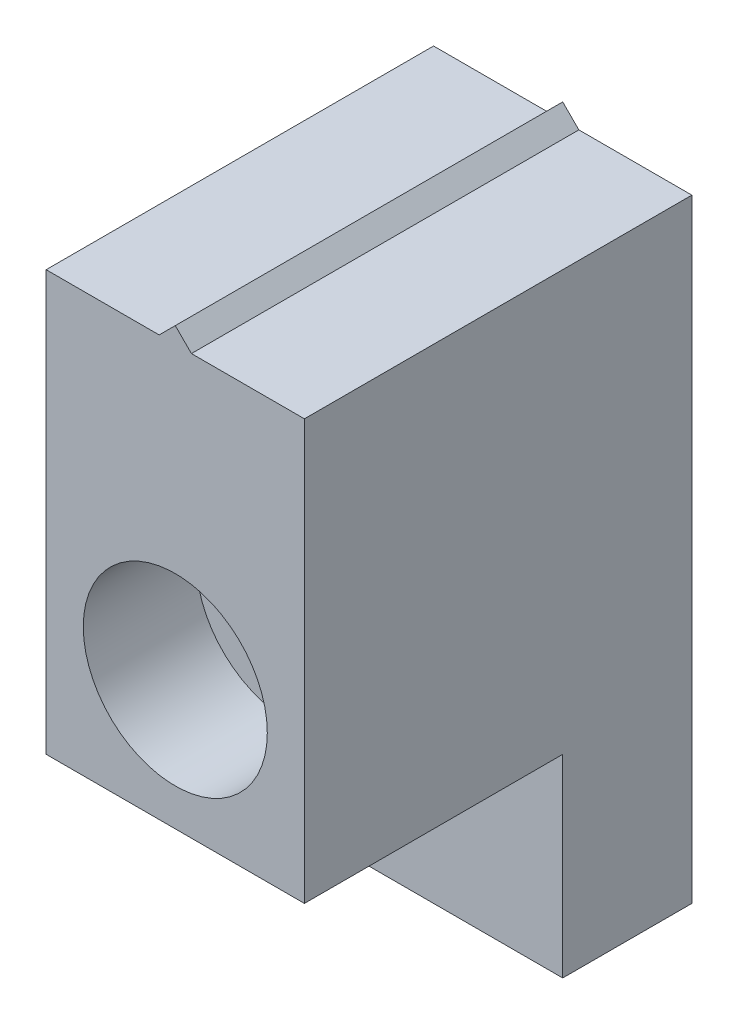
ISO-10303-21;
HEADER;
FILE_DESCRIPTION(('STEP AP214'),'2;1');
FILE_NAME('part.step','',(''),(''),'','','');
FILE_SCHEMA(('AUTOMOTIVE_DESIGN { 1 0 10303 214 1 1 1 1 }'));
ENDSEC;
DATA;
#1=APPLICATION_CONTEXT('core data for automotive mechanical design processes');
#2=APPLICATION_PROTOCOL_DEFINITION('international standard','automotive_design',2000,#1);
#3=PRODUCT_CONTEXT('',#1,'mechanical');
#4=PRODUCT('Part','Part','',(#3));
#5=PRODUCT_RELATED_PRODUCT_CATEGORY('part','',(#4));
#6=PRODUCT_DEFINITION_FORMATION('','',#4);
#7=PRODUCT_DEFINITION_CONTEXT('part definition',#1,'design');
#8=PRODUCT_DEFINITION('design','',#6,#7);
#9=PRODUCT_DEFINITION_SHAPE('','',#8);
#10=(LENGTH_UNIT() NAMED_UNIT(*) SI_UNIT(.MILLI.,.METRE.));
#11=(NAMED_UNIT(*) PLANE_ANGLE_UNIT() SI_UNIT($,.RADIAN.));
#12=(NAMED_UNIT(*) SI_UNIT($,.STERADIAN.) SOLID_ANGLE_UNIT());
#13=UNCERTAINTY_MEASURE_WITH_UNIT(LENGTH_MEASURE(1.E-05),#10,'distance_accuracy_value','');
#14=(GEOMETRIC_REPRESENTATION_CONTEXT(3) GLOBAL_UNCERTAINTY_ASSIGNED_CONTEXT((#13)) GLOBAL_UNIT_ASSIGNED_CONTEXT((#10,
#11,#12)) REPRESENTATION_CONTEXT('',''));
#15=CARTESIAN_POINT('',(0.,0.,0.));
#16=DIRECTION('',(0.,0.,1.));
#17=DIRECTION('',(1.,0.,0.));
#18=AXIS2_PLACEMENT_3D('',#15,#16,#17);
#19=CARTESIAN_POINT('',(4.00000005960464,19.5000002905726,0.));
#20=DIRECTION('',(-0.707106781186548,0.707106781186548,0.));
#21=DIRECTION('',(-0.707106781186548,-0.707106781186548,0.));
#22=AXIS2_PLACEMENT_3D('',#19,#20,#21);
#23=PLANE('',#22);
#24=DIRECTION('',(-0.707106781186548,-0.707106781186548,0.));
#25=VECTOR('',#24,1.);
#26=CARTESIAN_POINT('',(4.00000005960464,19.5000002905726,12.));
#27=LINE('',#26,#25);
#28=CARTESIAN_POINT('',(3.50000005215408,19.0000002831221,12.));
#29=VERTEX_POINT('',#28);
#30=CARTESIAN_POINT('',(4.00000005960465,19.5000002905726,12.));
#31=VERTEX_POINT('',#30);
#32=EDGE_CURVE('E90',#29,#31,#27,.F.);
#33=ORIENTED_EDGE('',*,*,#32,.T.);
#34=DIRECTION('',(0.,0.,1.));
#35=VECTOR('',#34,1.);
#36=CARTESIAN_POINT('',(4.00000005960469,19.5000002905726,0.));
#37=LINE('',#36,#35);
#38=CARTESIAN_POINT('',(4.00000005960465,19.5000002905726,0.));
#39=VERTEX_POINT('',#38);
#40=EDGE_CURVE('E93',#39,#31,#37,.T.);
#41=ORIENTED_EDGE('',*,*,#40,.F.);
#42=DIRECTION('',(-0.707106781186548,-0.707106781186548,0.));
#43=VECTOR('',#42,1.);
#44=CARTESIAN_POINT('',(4.00000005960464,19.5000002905726,0.));
#45=LINE('',#44,#43);
#46=CARTESIAN_POINT('',(3.50000005215408,19.0000002831221,0.));
#47=VERTEX_POINT('',#46);
#48=EDGE_CURVE('E85',#39,#47,#45,.T.);
#49=ORIENTED_EDGE('',*,*,#48,.T.);
#50=DIRECTION('',(0.,0.,1.));
#51=VECTOR('',#50,1.);
#52=CARTESIAN_POINT('',(3.50000005215406,19.0000002831221,0.));
#53=LINE('',#52,#51);
#54=EDGE_CURVE('E96',#29,#47,#53,.F.);
#55=ORIENTED_EDGE('',*,*,#54,.F.);
#56=EDGE_LOOP('',(#33,#41,#49,#55));
#57=FACE_BOUND('',#56,.T.);
#58=ADVANCED_FACE('F17',(#57),#23,.T.);
#59=CARTESIAN_POINT('',(4.00000005960464,10.0000001490116,8.5));
#60=DIRECTION('',(0.,0.,1.));
#61=DIRECTION('',(1.,0.,0.));
#62=AXIS2_PLACEMENT_3D('',#59,#60,#61);
#63=PLANE('',#62);
#64=CARTESIAN_POINT('',(4.00000005960464,10.0000001490116,8.5));
#65=DIRECTION('',(0.,0.,1.));
#66=DIRECTION('',(1.,0.,0.));
#67=AXIS2_PLACEMENT_3D('',#64,#65,#66);
#68=CIRCLE('',#67,1.55);
#69=CARTESIAN_POINT('',(5.55000005960464,10.0000001490116,8.5));
#70=VERTEX_POINT('',#69);
#71=EDGE_CURVE('E20',#70,#70,#68,.F.);
#72=ORIENTED_EDGE('',*,*,#71,.T.);
#73=EDGE_LOOP('',(#72));
#74=FACE_BOUND('',#73,.T.);
#75=CARTESIAN_POINT('',(4.00000005960464,10.0000001490116,8.5));
#76=DIRECTION('',(0.,0.,1.));
#77=DIRECTION('',(1.,0.,0.));
#78=AXIS2_PLACEMENT_3D('',#75,#76,#77);
#79=CIRCLE('',#78,2.85);
#80=CARTESIAN_POINT('',(6.85000005960464,10.0000001490116,8.5));
#81=VERTEX_POINT('',#80);
#82=EDGE_CURVE('E125',#81,#81,#79,.T.);
#83=ORIENTED_EDGE('',*,*,#82,.T.);
#84=EDGE_LOOP('',(#83));
#85=FACE_BOUND('',#84,.T.);
#86=ADVANCED_FACE('F302',(#74,#85),#63,.T.);
#87=CARTESIAN_POINT('',(4.00000005960464,10.0000001490116,0.));
#88=DIRECTION('',(0.,0.,1.));
#89=DIRECTION('',(1.,0.,0.));
#90=AXIS2_PLACEMENT_3D('',#87,#88,#89);
#91=CYLINDRICAL_SURFACE('',#90,1.55);
#92=CARTESIAN_POINT('',(4.00000005960464,10.0000001490116,0.));
#93=DIRECTION('',(0.,0.,1.));
#94=DIRECTION('',(1.,0.,0.));
#95=AXIS2_PLACEMENT_3D('',#92,#93,#94);
#96=CIRCLE('',#95,1.55);
#97=CARTESIAN_POINT('',(5.55000005960464,10.0000001490116,0.));
#98=VERTEX_POINT('',#97);
#99=EDGE_CURVE('E121',#98,#98,#96,.F.);
#100=ORIENTED_EDGE('',*,*,#99,.T.);
#101=EDGE_LOOP('',(#100));
#102=FACE_BOUND('',#101,.T.);
#103=ORIENTED_EDGE('',*,*,#71,.F.);
#104=EDGE_LOOP('',(#103));
#105=FACE_BOUND('',#104,.T.);
#106=ADVANCED_FACE('F206',(#102,#105),#91,.F.);
#107=CARTESIAN_POINT('',(4.50000006705523,19.0000002831221,0.));
#108=DIRECTION('',(0.707106781186548,0.707106781186548,0.));
#109=DIRECTION('',(-0.707106781186548,0.707106781186548,0.));
#110=AXIS2_PLACEMENT_3D('',#107,#108,#109);
#111=PLANE('',#110);
#112=DIRECTION('',(-0.707106781186548,0.707106781186548,0.));
#113=VECTOR('',#112,1.);
#114=CARTESIAN_POINT('',(4.50000006705523,19.0000002831221,12.));
#115=LINE('',#114,#113);
#116=CARTESIAN_POINT('',(4.50000006705523,19.0000002831221,12.));
#117=VERTEX_POINT('',#116);
#118=EDGE_CURVE('E102',#31,#117,#115,.F.);
#119=ORIENTED_EDGE('',*,*,#118,.T.);
#120=DIRECTION('',(0.,0.,1.));
#121=VECTOR('',#120,1.);
#122=CARTESIAN_POINT('',(4.50000006705523,19.0000002831221,0.));
#123=LINE('',#122,#121);
#124=CARTESIAN_POINT('',(4.50000006705523,19.0000002831221,0.));
#125=VERTEX_POINT('',#124);
#126=EDGE_CURVE('E123',#125,#117,#123,.T.);
#127=ORIENTED_EDGE('',*,*,#126,.F.);
#128=DIRECTION('',(-0.707106781186611,0.707106781186484,0.));
#129=VECTOR('',#128,1.);
#130=CARTESIAN_POINT('',(4.50000006705523,19.0000002831221,0.));
#131=LINE('',#130,#129);
#132=EDGE_CURVE('E110',#125,#39,#131,.T.);
#133=ORIENTED_EDGE('',*,*,#132,.T.);
#134=ORIENTED_EDGE('',*,*,#40,.T.);
#135=EDGE_LOOP('',(#119,#127,#133,#134));
#136=FACE_BOUND('',#135,.T.);
#137=ADVANCED_FACE('F109',(#136),#111,.T.);
#138=CARTESIAN_POINT('',(8.00000011920929,19.0000002831221,0.));
#139=DIRECTION('',(0.,1.,0.));
#140=DIRECTION('',(0.,0.,1.));
#141=AXIS2_PLACEMENT_3D('',#138,#139,#140);
#142=PLANE('',#141);
#143=DIRECTION('',(0.,0.,1.));
#144=VECTOR('',#143,1.);
#145=CARTESIAN_POINT('',(0.,19.0000002831221,0.));
#146=LINE('',#145,#144);
#147=CARTESIAN_POINT('',(0.,19.0000002831221,12.));
#148=VERTEX_POINT('',#147);
#149=CARTESIAN_POINT('',(0.,19.0000002831221,0.));
#150=VERTEX_POINT('',#149);
#151=EDGE_CURVE('E127',#148,#150,#146,.F.);
#152=ORIENTED_EDGE('',*,*,#151,.F.);
#153=DIRECTION('',(1.,0.,0.));
#154=VECTOR('',#153,1.);
#155=CARTESIAN_POINT('',(4.00000005960464,19.0000002831221,12.));
#156=LINE('',#155,#154);
#157=EDGE_CURVE('E120',#29,#148,#156,.F.);
#158=ORIENTED_EDGE('',*,*,#157,.F.);
#159=ORIENTED_EDGE('',*,*,#54,.T.);
#160=DIRECTION('',(1.,0.,0.));
#161=VECTOR('',#160,1.);
#162=CARTESIAN_POINT('',(4.00000005960464,19.0000002831221,0.));
#163=LINE('',#162,#161);
#164=EDGE_CURVE('E135',#47,#150,#163,.F.);
#165=ORIENTED_EDGE('',*,*,#164,.T.);
#166=EDGE_LOOP('',(#152,#158,#159,#165));
#167=FACE_BOUND('',#166,.T.);
#168=ADVANCED_FACE('F195',(#167),#142,.T.);
#169=CARTESIAN_POINT('',(4.00000005960464,10.0000001490116,0.));
#170=DIRECTION('',(0.,0.,1.));
#171=DIRECTION('',(1.,0.,0.));
#172=AXIS2_PLACEMENT_3D('',#169,#170,#171);
#173=CYLINDRICAL_SURFACE('',#172,2.85);
#174=ORIENTED_EDGE('',*,*,#82,.F.);
#175=EDGE_LOOP('',(#174));
#176=FACE_BOUND('',#175,.T.);
#177=CARTESIAN_POINT('',(4.00000005960464,10.0000001490116,12.));
#178=DIRECTION('',(0.,0.,1.));
#179=DIRECTION('',(1.,0.,0.));
#180=AXIS2_PLACEMENT_3D('',#177,#178,#179);
#181=CIRCLE('',#180,2.85);
#182=CARTESIAN_POINT('',(6.85000005960464,10.0000001490116,12.));
#183=VERTEX_POINT('',#182);
#184=EDGE_CURVE('E116',#183,#183,#181,.F.);
#185=ORIENTED_EDGE('',*,*,#184,.F.);
#186=EDGE_LOOP('',(#185));
#187=FACE_BOUND('',#186,.T.);
#188=ADVANCED_FACE('F197',(#176,#187),#173,.F.);
#189=CARTESIAN_POINT('',(0.,6.00000008940697,0.));
#190=DIRECTION('',(-1.,0.,0.));
#191=DIRECTION('',(0.,0.,1.));
#192=AXIS2_PLACEMENT_3D('',#189,#190,#191);
#193=PLANE('',#192);
#194=DIRECTION('',(0.,1.,0.));
#195=VECTOR('',#194,1.);
#196=CARTESIAN_POINT('',(0.,12.5000001862645,12.));
#197=LINE('',#196,#195);
#198=CARTESIAN_POINT('',(0.,6.00000008940697,12.));
#199=VERTEX_POINT('',#198);
#200=EDGE_CURVE('E142',#148,#199,#197,.F.);
#201=ORIENTED_EDGE('',*,*,#200,.F.);
#202=ORIENTED_EDGE('',*,*,#151,.T.);
#203=DIRECTION('',(0.,1.,0.));
#204=VECTOR('',#203,1.);
#205=CARTESIAN_POINT('',(0.,3.00000004470348,0.));
#206=LINE('',#205,#204);
#207=CARTESIAN_POINT('',(0.,0.,0.));
#208=VERTEX_POINT('',#207);
#209=EDGE_CURVE('E124',#150,#208,#206,.F.);
#210=ORIENTED_EDGE('',*,*,#209,.T.);
#211=DIRECTION('',(0.,0.,-1.));
#212=VECTOR('',#211,1.);
#213=CARTESIAN_POINT('',(0.,0.,0.));
#214=LINE('',#213,#212);
#215=CARTESIAN_POINT('',(0.,0.,4.));
#216=VERTEX_POINT('',#215);
#217=EDGE_CURVE('E160',#216,#208,#214,.T.);
#218=ORIENTED_EDGE('',*,*,#217,.F.);
#219=DIRECTION('',(0.,1.,0.));
#220=VECTOR('',#219,1.);
#221=CARTESIAN_POINT('',(0.,3.00000004470348,4.));
#222=LINE('',#221,#220);
#223=CARTESIAN_POINT('',(0.,6.00000008940697,4.));
#224=VERTEX_POINT('',#223);
#225=EDGE_CURVE('E151',#224,#216,#222,.F.);
#226=ORIENTED_EDGE('',*,*,#225,.F.);
#227=DIRECTION('',(0.,0.,-1.));
#228=VECTOR('',#227,1.);
#229=CARTESIAN_POINT('',(0.,6.00000008940697,0.));
#230=LINE('',#229,#228);
#231=EDGE_CURVE('E148',#199,#224,#230,.T.);
#232=ORIENTED_EDGE('',*,*,#231,.F.);
#233=EDGE_LOOP('',(#201,#202,#210,#218,#226,#232));
#234=FACE_BOUND('',#233,.T.);
#235=ADVANCED_FACE('F186',(#234),#193,.T.);
#236=CARTESIAN_POINT('',(4.00000005960464,3.00000004470348,0.));
#237=DIRECTION('',(0.,0.,1.));
#238=DIRECTION('',(1.,0.,0.));
#239=AXIS2_PLACEMENT_3D('',#236,#237,#238);
#240=PLANE('',#239);
#241=ORIENTED_EDGE('',*,*,#99,.F.);
#242=EDGE_LOOP('',(#241));
#243=FACE_BOUND('',#242,.T.);
#244=ORIENTED_EDGE('',*,*,#164,.F.);
#245=ORIENTED_EDGE('',*,*,#48,.F.);
#246=ORIENTED_EDGE('',*,*,#132,.F.);
#247=DIRECTION('',(1.,0.,0.));
#248=VECTOR('',#247,1.);
#249=CARTESIAN_POINT('',(8.00000011920929,19.0000002831221,0.));
#250=LINE('',#249,#248);
#251=CARTESIAN_POINT('',(8.00000011920929,19.0000002831221,0.));
#252=VERTEX_POINT('',#251);
#253=EDGE_CURVE('E139',#252,#125,#250,.F.);
#254=ORIENTED_EDGE('',*,*,#253,.F.);
#255=DIRECTION('',(0.,1.,0.));
#256=VECTOR('',#255,1.);
#257=CARTESIAN_POINT('',(8.00000011920929,0.,0.));
#258=LINE('',#257,#256);
#259=CARTESIAN_POINT('',(8.00000011920929,0.,0.));
#260=VERTEX_POINT('',#259);
#261=EDGE_CURVE('E163',#260,#252,#258,.T.);
#262=ORIENTED_EDGE('',*,*,#261,.F.);
#263=DIRECTION('',(1.,0.,0.));
#264=VECTOR('',#263,1.);
#265=CARTESIAN_POINT('',(0.,0.,0.));
#266=LINE('',#265,#264);
#267=EDGE_CURVE('E156',#208,#260,#266,.T.);
#268=ORIENTED_EDGE('',*,*,#267,.F.);
#269=ORIENTED_EDGE('',*,*,#209,.F.);
#270=EDGE_LOOP('',(#244,#245,#246,#254,#262,#268,#269));
#271=FACE_BOUND('',#270,.T.);
#272=ADVANCED_FACE('F191',(#243,#271),#240,.F.);
#273=CARTESIAN_POINT('',(8.00000011920929,19.0000002831221,0.));
#274=DIRECTION('',(0.,1.,0.));
#275=DIRECTION('',(0.,0.,1.));
#276=AXIS2_PLACEMENT_3D('',#273,#274,#275);
#277=PLANE('',#276);
#278=DIRECTION('',(0.,0.,-1.));
#279=VECTOR('',#278,1.);
#280=CARTESIAN_POINT('',(8.00000011920929,19.0000002831221,0.));
#281=LINE('',#280,#279);
#282=CARTESIAN_POINT('',(8.00000011920929,19.0000002831221,12.));
#283=VERTEX_POINT('',#282);
#284=EDGE_CURVE('E166',#252,#283,#281,.F.);
#285=ORIENTED_EDGE('',*,*,#284,.F.);
#286=ORIENTED_EDGE('',*,*,#253,.T.);
#287=ORIENTED_EDGE('',*,*,#126,.T.);
#288=DIRECTION('',(1.,0.,0.));
#289=VECTOR('',#288,1.);
#290=CARTESIAN_POINT('',(4.00000005960464,19.0000002831221,12.));
#291=LINE('',#290,#289);
#292=EDGE_CURVE('E105',#283,#117,#291,.F.);
#293=ORIENTED_EDGE('',*,*,#292,.F.);
#294=EDGE_LOOP('',(#285,#286,#287,#293));
#295=FACE_BOUND('',#294,.T.);
#296=ADVANCED_FACE('F194',(#295),#277,.T.);
#297=CARTESIAN_POINT('',(4.00000005960464,12.5000001862645,12.));
#298=DIRECTION('',(0.,0.,1.));
#299=DIRECTION('',(1.,0.,0.));
#300=AXIS2_PLACEMENT_3D('',#297,#298,#299);
#301=PLANE('',#300);
#302=ORIENTED_EDGE('',*,*,#184,.T.);
#303=EDGE_LOOP('',(#302));
#304=FACE_BOUND('',#303,.T.);
#305=ORIENTED_EDGE('',*,*,#32,.F.);
#306=ORIENTED_EDGE('',*,*,#157,.T.);
#307=ORIENTED_EDGE('',*,*,#200,.T.);
#308=DIRECTION('',(1.,0.,0.));
#309=VECTOR('',#308,1.);
#310=CARTESIAN_POINT('',(0.,6.00000008940697,12.));
#311=LINE('',#310,#309);
#312=CARTESIAN_POINT('',(8.00000011920929,6.00000008940697,12.));
#313=VERTEX_POINT('',#312);
#314=EDGE_CURVE('E119',#313,#199,#311,.F.);
#315=ORIENTED_EDGE('',*,*,#314,.F.);
#316=DIRECTION('',(0.,1.,0.));
#317=VECTOR('',#316,1.);
#318=CARTESIAN_POINT('',(8.00000011920929,0.,12.));
#319=LINE('',#318,#317);
#320=EDGE_CURVE('E169',#283,#313,#319,.F.);
#321=ORIENTED_EDGE('',*,*,#320,.F.);
#322=ORIENTED_EDGE('',*,*,#292,.T.);
#323=ORIENTED_EDGE('',*,*,#118,.F.);
#324=EDGE_LOOP('',(#305,#306,#307,#315,#321,#322,#323));
#325=FACE_BOUND('',#324,.T.);
#326=ADVANCED_FACE('F103',(#304,#325),#301,.T.);
#327=CARTESIAN_POINT('',(0.,6.00000008940697,0.));
#328=DIRECTION('',(0.,-1.,0.));
#329=DIRECTION('',(0.,0.,-1.));
#330=AXIS2_PLACEMENT_3D('',#327,#328,#329);
#331=PLANE('',#330);
#332=ORIENTED_EDGE('',*,*,#314,.T.);
#333=ORIENTED_EDGE('',*,*,#231,.T.);
#334=DIRECTION('',(1.,0.,0.));
#335=VECTOR('',#334,1.);
#336=CARTESIAN_POINT('',(4.00000005960464,6.00000008940697,4.));
#337=LINE('',#336,#335);
#338=CARTESIAN_POINT('',(8.00000011920929,6.00000008940697,4.));
#339=VERTEX_POINT('',#338);
#340=EDGE_CURVE('E153',#339,#224,#337,.F.);
#341=ORIENTED_EDGE('',*,*,#340,.F.);
#342=DIRECTION('',(0.,0.,-1.));
#343=VECTOR('',#342,1.);
#344=CARTESIAN_POINT('',(8.00000011920929,6.00000008940697,0.));
#345=LINE('',#344,#343);
#346=EDGE_CURVE('E172',#313,#339,#345,.T.);
#347=ORIENTED_EDGE('',*,*,#346,.F.);
#348=EDGE_LOOP('',(#332,#333,#341,#347));
#349=FACE_BOUND('',#348,.T.);
#350=ADVANCED_FACE('F182',(#349),#331,.T.);
#351=CARTESIAN_POINT('',(4.00000005960464,3.00000004470348,4.));
#352=DIRECTION('',(0.,0.,1.));
#353=DIRECTION('',(1.,0.,0.));
#354=AXIS2_PLACEMENT_3D('',#351,#352,#353);
#355=PLANE('',#354);
#356=DIRECTION('',(0.,1.,0.));
#357=VECTOR('',#356,1.);
#358=CARTESIAN_POINT('',(8.00000011920929,0.,4.));
#359=LINE('',#358,#357);
#360=CARTESIAN_POINT('',(8.00000011920929,0.,4.));
#361=VERTEX_POINT('',#360);
#362=EDGE_CURVE('E26',#339,#361,#359,.F.);
#363=ORIENTED_EDGE('',*,*,#362,.F.);
#364=ORIENTED_EDGE('',*,*,#340,.T.);
#365=ORIENTED_EDGE('',*,*,#225,.T.);
#366=DIRECTION('',(1.,0.,0.));
#367=VECTOR('',#366,1.);
#368=CARTESIAN_POINT('',(0.,0.,4.));
#369=LINE('',#368,#367);
#370=EDGE_CURVE('E35',#361,#216,#369,.F.);
#371=ORIENTED_EDGE('',*,*,#370,.F.);
#372=EDGE_LOOP('',(#363,#364,#365,#371));
#373=FACE_BOUND('',#372,.T.);
#374=ADVANCED_FACE('F179',(#373),#355,.T.);
#375=CARTESIAN_POINT('',(0.,0.,0.));
#376=DIRECTION('',(0.,-1.,0.));
#377=DIRECTION('',(0.,0.,-1.));
#378=AXIS2_PLACEMENT_3D('',#375,#376,#377);
#379=PLANE('',#378);
#380=ORIENTED_EDGE('',*,*,#370,.T.);
#381=ORIENTED_EDGE('',*,*,#217,.T.);
#382=ORIENTED_EDGE('',*,*,#267,.T.);
#383=DIRECTION('',(0.,0.,-1.));
#384=VECTOR('',#383,1.);
#385=CARTESIAN_POINT('',(8.00000011920929,0.,0.));
#386=LINE('',#385,#384);
#387=EDGE_CURVE('E11',#361,#260,#386,.T.);
#388=ORIENTED_EDGE('',*,*,#387,.F.);
#389=EDGE_LOOP('',(#380,#381,#382,#388));
#390=FACE_BOUND('',#389,.T.);
#391=ADVANCED_FACE('F190',(#390),#379,.T.);
#392=CARTESIAN_POINT('',(8.00000011920929,0.,0.));
#393=DIRECTION('',(1.,0.,0.));
#394=DIRECTION('',(0.,0.,-1.));
#395=AXIS2_PLACEMENT_3D('',#392,#393,#394);
#396=PLANE('',#395);
#397=ORIENTED_EDGE('',*,*,#362,.T.);
#398=ORIENTED_EDGE('',*,*,#387,.T.);
#399=ORIENTED_EDGE('',*,*,#261,.T.);
#400=ORIENTED_EDGE('',*,*,#284,.T.);
#401=ORIENTED_EDGE('',*,*,#320,.T.);
#402=ORIENTED_EDGE('',*,*,#346,.T.);
#403=EDGE_LOOP('',(#397,#398,#399,#400,#401,#402));
#404=FACE_BOUND('',#403,.T.);
#405=ADVANCED_FACE('F177',(#404),#396,.T.);
#406=CLOSED_SHELL('',(#58,#86,#106,#137,#168,#188,#235,#272,#296,#326,#350,#374,#391,#405));
#407=MANIFOLD_SOLID_BREP('B1',#406);
#408=ADVANCED_BREP_SHAPE_REPRESENTATION('',(#18,#407),#14);
#409=SHAPE_DEFINITION_REPRESENTATION(#9,#408);
ENDSEC;
END-ISO-10303-21;
